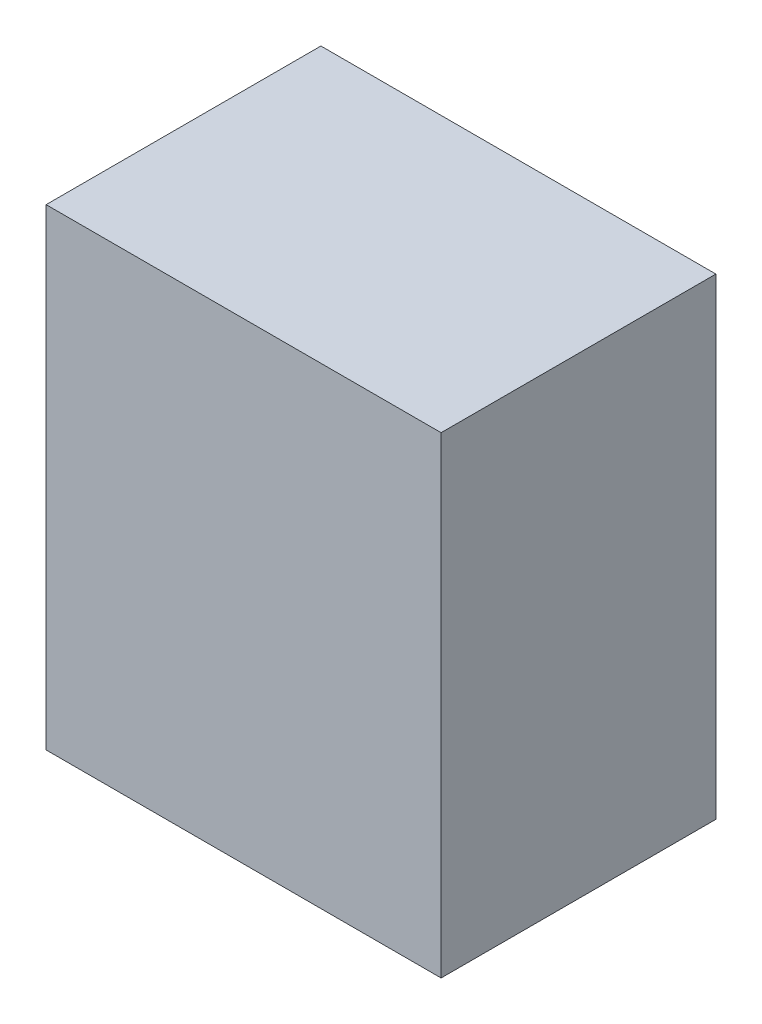
ISO-10303-21;
HEADER;
FILE_DESCRIPTION(('STEP AP214'),'2;1');
FILE_NAME('part.step','',(''),(''),'','','');
FILE_SCHEMA(('AUTOMOTIVE_DESIGN { 1 0 10303 214 1 1 1 1 }'));
ENDSEC;
DATA;
#1=APPLICATION_CONTEXT('core data for automotive mechanical design processes');
#2=APPLICATION_PROTOCOL_DEFINITION('international standard','automotive_design',2000,#1);
#3=PRODUCT_CONTEXT('',#1,'mechanical');
#4=PRODUCT('Part','Part','',(#3));
#5=PRODUCT_RELATED_PRODUCT_CATEGORY('part','',(#4));
#6=PRODUCT_DEFINITION_FORMATION('','',#4);
#7=PRODUCT_DEFINITION_CONTEXT('part definition',#1,'design');
#8=PRODUCT_DEFINITION('design','',#6,#7);
#9=PRODUCT_DEFINITION_SHAPE('','',#8);
#10=(LENGTH_UNIT() NAMED_UNIT(*) SI_UNIT(.MILLI.,.METRE.));
#11=(NAMED_UNIT(*) PLANE_ANGLE_UNIT() SI_UNIT($,.RADIAN.));
#12=(NAMED_UNIT(*) SI_UNIT($,.STERADIAN.) SOLID_ANGLE_UNIT());
#13=UNCERTAINTY_MEASURE_WITH_UNIT(LENGTH_MEASURE(1.E-05),#10,'distance_accuracy_value','');
#14=(GEOMETRIC_REPRESENTATION_CONTEXT(3) GLOBAL_UNCERTAINTY_ASSIGNED_CONTEXT((#13)) GLOBAL_UNIT_ASSIGNED_CONTEXT((#10,
#11,#12)) REPRESENTATION_CONTEXT('',''));
#15=CARTESIAN_POINT('',(0.,0.,0.));
#16=DIRECTION('',(0.,0.,1.));
#17=DIRECTION('',(1.,0.,0.));
#18=AXIS2_PLACEMENT_3D('',#15,#16,#17);
#19=CARTESIAN_POINT('',(-0.57500012,-0.68749926,0.8));
#20=DIRECTION('',(0.,0.,-1.));
#21=DIRECTION('',(-1.,0.,0.));
#22=AXIS2_PLACEMENT_3D('',#19,#20,#21);
#23=PLANE('',#22);
#24=DIRECTION('',(0.,1.,0.));
#25=VECTOR('',#24,1.);
#26=CARTESIAN_POINT('',(0.57500012,-0.68749926,0.8));
#27=LINE('',#26,#25);
#28=CARTESIAN_POINT('',(0.57500012,-0.68749926,0.8));
#29=VERTEX_POINT('',#28);
#30=CARTESIAN_POINT('',(0.57500012,0.6875018,0.8));
#31=VERTEX_POINT('',#30);
#32=EDGE_CURVE('E55',#29,#31,#27,.T.);
#33=ORIENTED_EDGE('',*,*,#32,.T.);
#34=DIRECTION('',(1.,0.,0.));
#35=VECTOR('',#34,1.);
#36=CARTESIAN_POINT('',(0.57500012,0.6875018,0.8));
#37=LINE('',#36,#35);
#38=CARTESIAN_POINT('',(-0.57500012,0.6875018,0.8));
#39=VERTEX_POINT('',#38);
#40=EDGE_CURVE('E57',#31,#39,#37,.F.);
#41=ORIENTED_EDGE('',*,*,#40,.T.);
#42=DIRECTION('',(0.,1.,0.));
#43=VECTOR('',#42,1.);
#44=CARTESIAN_POINT('',(-0.57500012,0.6875018,0.8));
#45=LINE('',#44,#43);
#46=CARTESIAN_POINT('',(-0.57500012,-0.68749926,0.8));
#47=VERTEX_POINT('',#46);
#48=EDGE_CURVE('E20',#39,#47,#45,.F.);
#49=ORIENTED_EDGE('',*,*,#48,.T.);
#50=DIRECTION('',(1.,0.,0.));
#51=VECTOR('',#50,1.);
#52=CARTESIAN_POINT('',(-0.57500012,-0.68749926,0.8));
#53=LINE('',#52,#51);
#54=EDGE_CURVE('E80',#47,#29,#53,.T.);
#55=ORIENTED_EDGE('',*,*,#54,.T.);
#56=EDGE_LOOP('',(#33,#41,#49,#55));
#57=FACE_BOUND('',#56,.T.);
#58=ADVANCED_FACE('F17',(#57),#23,.F.);
#59=CARTESIAN_POINT('',(-0.57500012,0.6875018,0.));
#60=DIRECTION('',(1.,0.,0.));
#61=DIRECTION('',(0.,0.,-1.));
#62=AXIS2_PLACEMENT_3D('',#59,#60,#61);
#63=PLANE('',#62);
#64=DIRECTION('',(0.,0.,1.));
#65=VECTOR('',#64,1.);
#66=CARTESIAN_POINT('',(-0.57500012,-0.68749926,0.));
#67=LINE('',#66,#65);
#68=CARTESIAN_POINT('',(-0.57500012,-0.68749926,0.));
#69=VERTEX_POINT('',#68);
#70=EDGE_CURVE('E68',#69,#47,#67,.T.);
#71=ORIENTED_EDGE('',*,*,#70,.T.);
#72=ORIENTED_EDGE('',*,*,#48,.F.);
#73=DIRECTION('',(0.,0.,-1.));
#74=VECTOR('',#73,1.);
#75=CARTESIAN_POINT('',(-0.57500012,0.6875018,0.));
#76=LINE('',#75,#74);
#77=CARTESIAN_POINT('',(-0.57500012,0.6875018,0.));
#78=VERTEX_POINT('',#77);
#79=EDGE_CURVE('E63',#39,#78,#76,.T.);
#80=ORIENTED_EDGE('',*,*,#79,.T.);
#81=DIRECTION('',(0.,1.,0.));
#82=VECTOR('',#81,1.);
#83=CARTESIAN_POINT('',(-0.57500012,-0.68749926,0.));
#84=LINE('',#83,#82);
#85=EDGE_CURVE('E83',#69,#78,#84,.T.);
#86=ORIENTED_EDGE('',*,*,#85,.F.);
#87=EDGE_LOOP('',(#71,#72,#80,#86));
#88=FACE_BOUND('',#87,.T.);
#89=ADVANCED_FACE('F65',(#88),#63,.F.);
#90=CARTESIAN_POINT('',(0.57500012,0.6875018,0.));
#91=DIRECTION('',(0.,-1.,0.));
#92=DIRECTION('',(0.,0.,-1.));
#93=AXIS2_PLACEMENT_3D('',#90,#91,#92);
#94=PLANE('',#93);
#95=ORIENTED_EDGE('',*,*,#79,.F.);
#96=ORIENTED_EDGE('',*,*,#40,.F.);
#97=DIRECTION('',(0.,0.,1.));
#98=VECTOR('',#97,1.);
#99=CARTESIAN_POINT('',(0.57500012,0.6875018,0.));
#100=LINE('',#99,#98);
#101=CARTESIAN_POINT('',(0.57500012,0.6875018,0.));
#102=VERTEX_POINT('',#101);
#103=EDGE_CURVE('E75',#31,#102,#100,.F.);
#104=ORIENTED_EDGE('',*,*,#103,.T.);
#105=DIRECTION('',(-1.,0.,0.));
#106=VECTOR('',#105,1.);
#107=CARTESIAN_POINT('',(-0.57500012,0.6875018,0.));
#108=LINE('',#107,#106);
#109=EDGE_CURVE('E72',#78,#102,#108,.F.);
#110=ORIENTED_EDGE('',*,*,#109,.F.);
#111=EDGE_LOOP('',(#95,#96,#104,#110));
#112=FACE_BOUND('',#111,.T.);
#113=ADVANCED_FACE('F70',(#112),#94,.F.);
#114=CARTESIAN_POINT('',(0.57500012,-0.68749926,0.));
#115=DIRECTION('',(-1.,0.,0.));
#116=DIRECTION('',(0.,0.,1.));
#117=AXIS2_PLACEMENT_3D('',#114,#115,#116);
#118=PLANE('',#117);
#119=ORIENTED_EDGE('',*,*,#103,.F.);
#120=ORIENTED_EDGE('',*,*,#32,.F.);
#121=DIRECTION('',(0.,0.,1.));
#122=VECTOR('',#121,1.);
#123=CARTESIAN_POINT('',(0.57500012,-0.68749926,0.));
#124=LINE('',#123,#122);
#125=CARTESIAN_POINT('',(0.57500012,-0.68749926,0.));
#126=VERTEX_POINT('',#125);
#127=EDGE_CURVE('E35',#29,#126,#124,.F.);
#128=ORIENTED_EDGE('',*,*,#127,.T.);
#129=DIRECTION('',(0.,1.,0.));
#130=VECTOR('',#129,1.);
#131=CARTESIAN_POINT('',(0.57500012,-0.68749926,0.));
#132=LINE('',#131,#130);
#133=EDGE_CURVE('E26',#102,#126,#132,.F.);
#134=ORIENTED_EDGE('',*,*,#133,.F.);
#135=EDGE_LOOP('',(#119,#120,#128,#134));
#136=FACE_BOUND('',#135,.T.);
#137=ADVANCED_FACE('F89',(#136),#118,.F.);
#138=CARTESIAN_POINT('',(-0.57500012,-0.68749926,0.));
#139=DIRECTION('',(0.,1.,0.));
#140=DIRECTION('',(0.,0.,1.));
#141=AXIS2_PLACEMENT_3D('',#138,#139,#140);
#142=PLANE('',#141);
#143=ORIENTED_EDGE('',*,*,#127,.F.);
#144=ORIENTED_EDGE('',*,*,#54,.F.);
#145=ORIENTED_EDGE('',*,*,#70,.F.);
#146=DIRECTION('',(-1.,0.,0.));
#147=VECTOR('',#146,1.);
#148=CARTESIAN_POINT('',(-0.57500012,-0.68749926,0.));
#149=LINE('',#148,#147);
#150=EDGE_CURVE('E11',#126,#69,#149,.T.);
#151=ORIENTED_EDGE('',*,*,#150,.F.);
#152=EDGE_LOOP('',(#143,#144,#145,#151));
#153=FACE_BOUND('',#152,.T.);
#154=ADVANCED_FACE('F91',(#153),#142,.F.);
#155=CARTESIAN_POINT('',(-0.57500012,-0.68749926,0.));
#156=DIRECTION('',(0.,0.,-1.));
#157=DIRECTION('',(-1.,0.,0.));
#158=AXIS2_PLACEMENT_3D('',#155,#156,#157);
#159=PLANE('',#158);
#160=ORIENTED_EDGE('',*,*,#133,.T.);
#161=ORIENTED_EDGE('',*,*,#150,.T.);
#162=ORIENTED_EDGE('',*,*,#85,.T.);
#163=ORIENTED_EDGE('',*,*,#109,.T.);
#164=EDGE_LOOP('',(#160,#161,#162,#163));
#165=FACE_BOUND('',#164,.T.);
#166=ADVANCED_FACE('F88',(#165),#159,.T.);
#167=CLOSED_SHELL('',(#58,#89,#113,#137,#154,#166));
#168=MANIFOLD_SOLID_BREP('B1',#167);
#169=ADVANCED_BREP_SHAPE_REPRESENTATION('',(#18,#168),#14);
#170=SHAPE_DEFINITION_REPRESENTATION(#9,#169);
ENDSEC;
END-ISO-10303-21;
